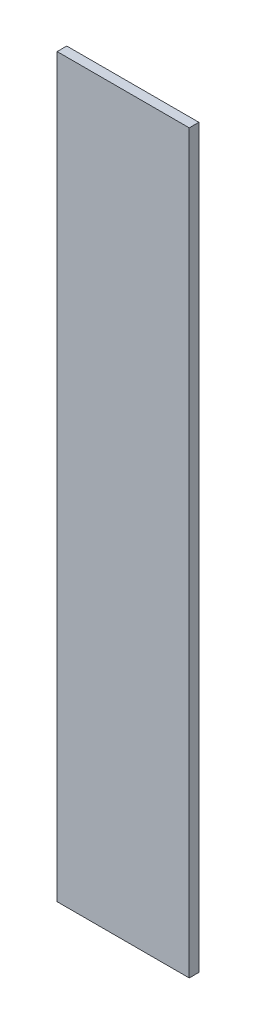
ISO-10303-21;
HEADER;
FILE_DESCRIPTION(('STEP AP214'),'2;1');
FILE_NAME('part.step','',(''),(''),'','','');
FILE_SCHEMA(('AUTOMOTIVE_DESIGN { 1 0 10303 214 1 1 1 1 }'));
ENDSEC;
DATA;
#1=APPLICATION_CONTEXT('core data for automotive mechanical design processes');
#2=APPLICATION_PROTOCOL_DEFINITION('international standard','automotive_design',2000,#1);
#3=PRODUCT_CONTEXT('',#1,'mechanical');
#4=PRODUCT('Part','Part','',(#3));
#5=PRODUCT_RELATED_PRODUCT_CATEGORY('part','',(#4));
#6=PRODUCT_DEFINITION_FORMATION('','',#4);
#7=PRODUCT_DEFINITION_CONTEXT('part definition',#1,'design');
#8=PRODUCT_DEFINITION('design','',#6,#7);
#9=PRODUCT_DEFINITION_SHAPE('','',#8);
#10=(LENGTH_UNIT() NAMED_UNIT(*) SI_UNIT(.MILLI.,.METRE.));
#11=(NAMED_UNIT(*) PLANE_ANGLE_UNIT() SI_UNIT($,.RADIAN.));
#12=(NAMED_UNIT(*) SI_UNIT($,.STERADIAN.) SOLID_ANGLE_UNIT());
#13=UNCERTAINTY_MEASURE_WITH_UNIT(LENGTH_MEASURE(1.E-05),#10,'distance_accuracy_value','');
#14=(GEOMETRIC_REPRESENTATION_CONTEXT(3) GLOBAL_UNCERTAINTY_ASSIGNED_CONTEXT((#13)) GLOBAL_UNIT_ASSIGNED_CONTEXT((#10,
#11,#12)) REPRESENTATION_CONTEXT('',''));
#15=CARTESIAN_POINT('',(0.,0.,0.));
#16=DIRECTION('',(0.,0.,1.));
#17=DIRECTION('',(1.,0.,0.));
#18=AXIS2_PLACEMENT_3D('',#15,#16,#17);
#19=CARTESIAN_POINT('',(-34.0000000000001,394.959461551983,4.953));
#20=DIRECTION('',(1.,0.,0.));
#21=DIRECTION('',(0.,1.,0.));
#22=AXIS2_PLACEMENT_3D('',#19,#20,#21);
#23=PLANE('',#22);
#24=DIRECTION('',(0.,-1.,0.));
#25=VECTOR('',#24,1.);
#26=CARTESIAN_POINT('',(-34.0000000000001,394.959461551983,0.));
#27=LINE('',#26,#25);
#28=CARTESIAN_POINT('',(-34.0000000000001,394.959461551983,0.));
#29=VERTEX_POINT('',#28);
#30=CARTESIAN_POINT('',(-34.,16.,0.));
#31=VERTEX_POINT('',#30);
#32=EDGE_CURVE('E96',#29,#31,#27,.T.);
#33=ORIENTED_EDGE('',*,*,#32,.T.);
#34=DIRECTION('',(0.,0.,-1.));
#35=VECTOR('',#34,1.);
#36=CARTESIAN_POINT('',(-34.,16.,4.953));
#37=LINE('',#36,#35);
#38=CARTESIAN_POINT('',(-34.,16.,4.953));
#39=VERTEX_POINT('',#38);
#40=EDGE_CURVE('E11',#39,#31,#37,.T.);
#41=ORIENTED_EDGE('',*,*,#40,.F.);
#42=DIRECTION('',(0.,-1.,0.));
#43=VECTOR('',#42,1.);
#44=CARTESIAN_POINT('',(-34.0000000000001,394.959461551983,4.953));
#45=LINE('',#44,#43);
#46=CARTESIAN_POINT('',(-34.0000000000001,394.959461551983,4.953));
#47=VERTEX_POINT('',#46);
#48=EDGE_CURVE('E84',#47,#39,#45,.T.);
#49=ORIENTED_EDGE('',*,*,#48,.F.);
#50=DIRECTION('',(0.,0.,-1.));
#51=VECTOR('',#50,1.);
#52=CARTESIAN_POINT('',(-34.0000000000001,394.959461551983,4.953));
#53=LINE('',#52,#51);
#54=EDGE_CURVE('E92',#47,#29,#53,.T.);
#55=ORIENTED_EDGE('',*,*,#54,.T.);
#56=EDGE_LOOP('',(#33,#41,#49,#55));
#57=FACE_BOUND('',#56,.T.);
#58=ADVANCED_FACE('F33',(#57),#23,.F.);
#59=CARTESIAN_POINT('',(-34.,16.,4.953));
#60=DIRECTION('',(0.,1.,0.));
#61=DIRECTION('',(0.,0.,1.));
#62=AXIS2_PLACEMENT_3D('',#59,#60,#61);
#63=PLANE('',#62);
#64=DIRECTION('',(1.,0.,0.));
#65=VECTOR('',#64,1.);
#66=CARTESIAN_POINT('',(-34.,16.,0.));
#67=LINE('',#66,#65);
#68=CARTESIAN_POINT('',(34.,16.,0.));
#69=VERTEX_POINT('',#68);
#70=EDGE_CURVE('E88',#31,#69,#67,.T.);
#71=ORIENTED_EDGE('',*,*,#70,.T.);
#72=DIRECTION('',(0.,0.,-1.));
#73=VECTOR('',#72,1.);
#74=CARTESIAN_POINT('',(34.,16.,4.953));
#75=LINE('',#74,#73);
#76=CARTESIAN_POINT('',(34.,16.,4.953));
#77=VERTEX_POINT('',#76);
#78=EDGE_CURVE('E41',#77,#69,#75,.T.);
#79=ORIENTED_EDGE('',*,*,#78,.F.);
#80=DIRECTION('',(1.,0.,0.));
#81=VECTOR('',#80,1.);
#82=CARTESIAN_POINT('',(-34.,16.,4.953));
#83=LINE('',#82,#81);
#84=EDGE_CURVE('E79',#39,#77,#83,.T.);
#85=ORIENTED_EDGE('',*,*,#84,.F.);
#86=ORIENTED_EDGE('',*,*,#40,.T.);
#87=EDGE_LOOP('',(#71,#79,#85,#86));
#88=FACE_BOUND('',#87,.T.);
#89=ADVANCED_FACE('F87',(#88),#63,.F.);
#90=CARTESIAN_POINT('',(34.,394.959461551983,4.953));
#91=DIRECTION('',(-1.,0.,0.));
#92=DIRECTION('',(0.,-1.,0.));
#93=AXIS2_PLACEMENT_3D('',#90,#91,#92);
#94=PLANE('',#93);
#95=DIRECTION('',(0.,1.,0.));
#96=VECTOR('',#95,1.);
#97=CARTESIAN_POINT('',(34.,394.959461551983,0.));
#98=LINE('',#97,#96);
#99=CARTESIAN_POINT('',(34.,394.959461551983,0.));
#100=VERTEX_POINT('',#99);
#101=EDGE_CURVE('E66',#69,#100,#98,.T.);
#102=ORIENTED_EDGE('',*,*,#101,.T.);
#103=DIRECTION('',(0.,0.,-1.));
#104=VECTOR('',#103,1.);
#105=CARTESIAN_POINT('',(34.,394.959461551983,4.953));
#106=LINE('',#105,#104);
#107=CARTESIAN_POINT('',(34.,394.959461551983,4.953));
#108=VERTEX_POINT('',#107);
#109=EDGE_CURVE('E89',#108,#100,#106,.T.);
#110=ORIENTED_EDGE('',*,*,#109,.F.);
#111=DIRECTION('',(0.,1.,0.));
#112=VECTOR('',#111,1.);
#113=CARTESIAN_POINT('',(34.,394.959461551983,4.953));
#114=LINE('',#113,#112);
#115=EDGE_CURVE('E82',#77,#108,#114,.T.);
#116=ORIENTED_EDGE('',*,*,#115,.F.);
#117=ORIENTED_EDGE('',*,*,#78,.T.);
#118=EDGE_LOOP('',(#102,#110,#116,#117));
#119=FACE_BOUND('',#118,.T.);
#120=ADVANCED_FACE('F90',(#119),#94,.F.);
#121=CARTESIAN_POINT('',(-34.0000000000001,394.959461551983,4.953));
#122=DIRECTION('',(0.,-1.,0.));
#123=DIRECTION('',(0.,0.,-1.));
#124=AXIS2_PLACEMENT_3D('',#121,#122,#123);
#125=PLANE('',#124);
#126=DIRECTION('',(-1.,0.,0.));
#127=VECTOR('',#126,1.);
#128=CARTESIAN_POINT('',(-34.0000000000001,394.959461551983,0.));
#129=LINE('',#128,#127);
#130=EDGE_CURVE('E72',#100,#29,#129,.T.);
#131=ORIENTED_EDGE('',*,*,#130,.T.);
#132=ORIENTED_EDGE('',*,*,#54,.F.);
#133=DIRECTION('',(-1.,0.,0.));
#134=VECTOR('',#133,1.);
#135=CARTESIAN_POINT('',(-34.0000000000001,394.959461551983,4.953));
#136=LINE('',#135,#134);
#137=EDGE_CURVE('E49',#108,#47,#136,.T.);
#138=ORIENTED_EDGE('',*,*,#137,.F.);
#139=ORIENTED_EDGE('',*,*,#109,.T.);
#140=EDGE_LOOP('',(#131,#132,#138,#139));
#141=FACE_BOUND('',#140,.T.);
#142=ADVANCED_FACE('F103',(#141),#125,.F.);
#143=CARTESIAN_POINT('',(0.,0.,4.953));
#144=DIRECTION('',(0.,0.,1.));
#145=DIRECTION('',(1.,0.,0.));
#146=AXIS2_PLACEMENT_3D('',#143,#144,#145);
#147=PLANE('',#146);
#148=ORIENTED_EDGE('',*,*,#48,.T.);
#149=ORIENTED_EDGE('',*,*,#84,.T.);
#150=ORIENTED_EDGE('',*,*,#115,.T.);
#151=ORIENTED_EDGE('',*,*,#137,.T.);
#152=EDGE_LOOP('',(#148,#149,#150,#151));
#153=FACE_BOUND('',#152,.T.);
#154=ADVANCED_FACE('F80',(#153),#147,.T.);
#155=CARTESIAN_POINT('',(0.,0.,0.));
#156=DIRECTION('',(0.,0.,1.));
#157=DIRECTION('',(1.,0.,0.));
#158=AXIS2_PLACEMENT_3D('',#155,#156,#157);
#159=PLANE('',#158);
#160=ORIENTED_EDGE('',*,*,#32,.F.);
#161=ORIENTED_EDGE('',*,*,#130,.F.);
#162=ORIENTED_EDGE('',*,*,#101,.F.);
#163=ORIENTED_EDGE('',*,*,#70,.F.);
#164=EDGE_LOOP('',(#160,#161,#162,#163));
#165=FACE_BOUND('',#164,.T.);
#166=ADVANCED_FACE('F106',(#165),#159,.F.);
#167=CLOSED_SHELL('',(#58,#89,#120,#142,#154,#166));
#168=MANIFOLD_SOLID_BREP('B2',#167);
#169=ADVANCED_BREP_SHAPE_REPRESENTATION('',(#18,#168),#14);
#170=SHAPE_DEFINITION_REPRESENTATION(#9,#169);
ENDSEC;
END-ISO-10303-21;
